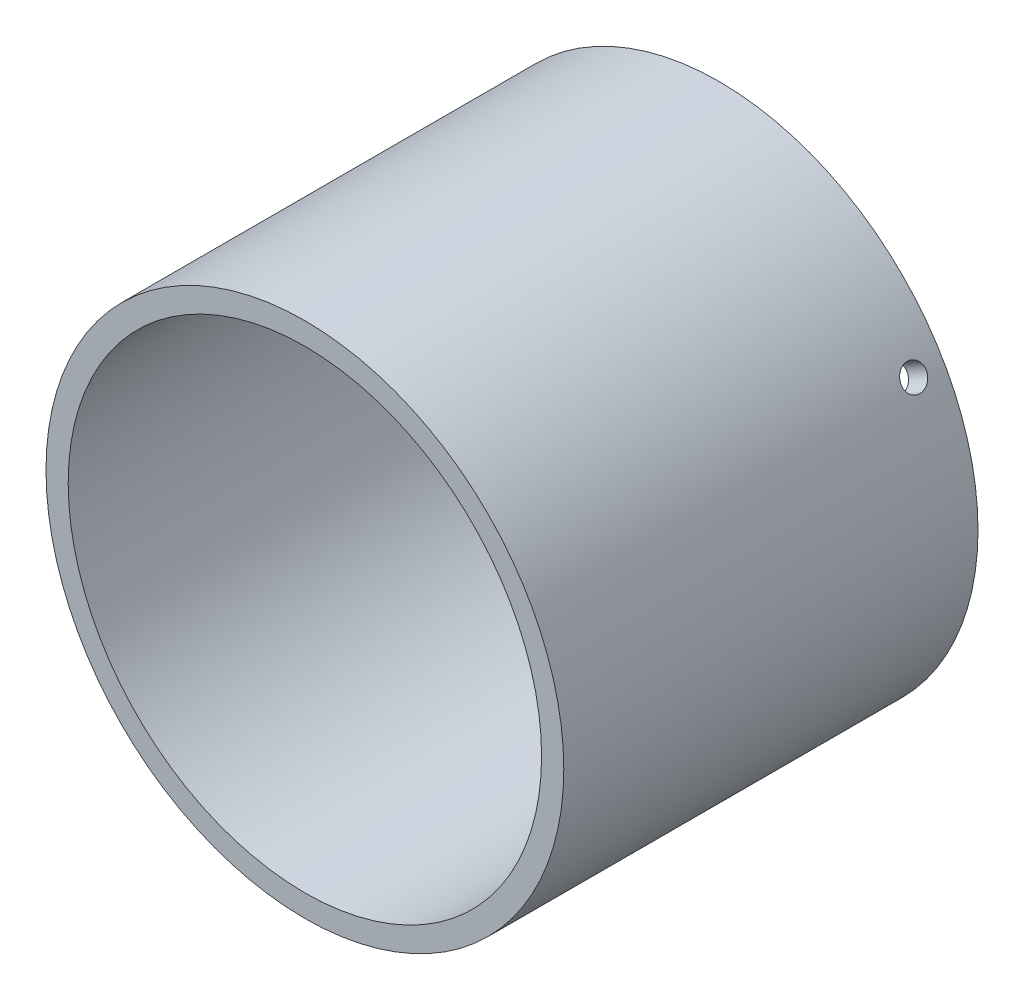
ISO-10303-21;
HEADER;
FILE_DESCRIPTION(('STEP AP214'),'2;1');
FILE_NAME('part.step','',(''),(''),'','','');
FILE_SCHEMA(('AUTOMOTIVE_DESIGN { 1 0 10303 214 1 1 1 1 }'));
ENDSEC;
DATA;
#1=APPLICATION_CONTEXT('core data for automotive mechanical design processes');
#2=APPLICATION_PROTOCOL_DEFINITION('international standard','automotive_design',2000,#1);
#3=PRODUCT_CONTEXT('',#1,'mechanical');
#4=PRODUCT('Part','Part','',(#3));
#5=PRODUCT_RELATED_PRODUCT_CATEGORY('part','',(#4));
#6=PRODUCT_DEFINITION_FORMATION('','',#4);
#7=PRODUCT_DEFINITION_CONTEXT('part definition',#1,'design');
#8=PRODUCT_DEFINITION('design','',#6,#7);
#9=PRODUCT_DEFINITION_SHAPE('','',#8);
#10=(LENGTH_UNIT() NAMED_UNIT(*) SI_UNIT(.MILLI.,.METRE.));
#11=(NAMED_UNIT(*) PLANE_ANGLE_UNIT() SI_UNIT($,.RADIAN.));
#12=(NAMED_UNIT(*) SI_UNIT($,.STERADIAN.) SOLID_ANGLE_UNIT());
#13=UNCERTAINTY_MEASURE_WITH_UNIT(LENGTH_MEASURE(1.E-05),#10,'distance_accuracy_value','');
#14=(GEOMETRIC_REPRESENTATION_CONTEXT(3) GLOBAL_UNCERTAINTY_ASSIGNED_CONTEXT((#13)) GLOBAL_UNIT_ASSIGNED_CONTEXT((#10,
#11,#12)) REPRESENTATION_CONTEXT('',''));
#15=CARTESIAN_POINT('',(0.,0.,0.));
#16=DIRECTION('',(0.,0.,1.));
#17=DIRECTION('',(1.,0.,0.));
#18=AXIS2_PLACEMENT_3D('',#15,#16,#17);
#19=CARTESIAN_POINT('',(0.,0.,56.));
#20=DIRECTION('',(0.,0.,1.));
#21=DIRECTION('',(1.,0.,0.));
#22=AXIS2_PLACEMENT_3D('',#19,#20,#21);
#23=PLANE('',#22);
#24=CARTESIAN_POINT('',(0.,0.,56.));
#25=DIRECTION('',(0.,0.,1.));
#26=DIRECTION('',(1.,0.,0.));
#27=AXIS2_PLACEMENT_3D('',#24,#25,#26);
#28=CIRCLE('',#27,35.);
#29=CARTESIAN_POINT('',(35.,0.,56.));
#30=VERTEX_POINT('',#29);
#31=EDGE_CURVE('E10',#30,#30,#28,.T.);
#32=ORIENTED_EDGE('',*,*,#31,.T.);
#33=EDGE_LOOP('',(#32));
#34=FACE_BOUND('',#33,.T.);
#35=CARTESIAN_POINT('',(0.,0.,56.));
#36=DIRECTION('',(0.,0.,1.));
#37=DIRECTION('',(1.,0.,0.));
#38=AXIS2_PLACEMENT_3D('',#35,#36,#37);
#39=CIRCLE('',#38,32.);
#40=CARTESIAN_POINT('',(32.,0.,56.));
#41=VERTEX_POINT('',#40);
#42=EDGE_CURVE('E49',#41,#41,#39,.T.);
#43=ORIENTED_EDGE('',*,*,#42,.F.);
#44=EDGE_LOOP('',(#43));
#45=FACE_BOUND('',#44,.T.);
#46=ADVANCED_FACE('F30',(#34,#45),#23,.T.);
#47=CARTESIAN_POINT('',(0.,0.,0.));
#48=DIRECTION('',(0.,0.,1.));
#49=DIRECTION('',(1.,0.,0.));
#50=AXIS2_PLACEMENT_3D('',#47,#48,#49);
#51=PLANE('',#50);
#52=CARTESIAN_POINT('',(0.,0.,0.));
#53=DIRECTION('',(0.,0.,1.));
#54=DIRECTION('',(1.,0.,0.));
#55=AXIS2_PLACEMENT_3D('',#52,#53,#54);
#56=CIRCLE('',#55,35.);
#57=CARTESIAN_POINT('',(35.,0.,0.));
#58=VERTEX_POINT('',#57);
#59=EDGE_CURVE('E44',#58,#58,#56,.T.);
#60=ORIENTED_EDGE('',*,*,#59,.F.);
#61=EDGE_LOOP('',(#60));
#62=FACE_BOUND('',#61,.T.);
#63=CARTESIAN_POINT('',(0.,0.,0.));
#64=DIRECTION('',(0.,0.,1.));
#65=DIRECTION('',(1.,0.,0.));
#66=AXIS2_PLACEMENT_3D('',#63,#64,#65);
#67=CIRCLE('',#66,32.);
#68=CARTESIAN_POINT('',(32.,0.,0.));
#69=VERTEX_POINT('',#68);
#70=EDGE_CURVE('E84',#69,#69,#67,.T.);
#71=ORIENTED_EDGE('',*,*,#70,.T.);
#72=EDGE_LOOP('',(#71));
#73=FACE_BOUND('',#72,.T.);
#74=ADVANCED_FACE('F96',(#62,#73),#51,.F.);
#75=CARTESIAN_POINT('',(0.,0.,56.));
#76=DIRECTION('',(0.,0.,-1.));
#77=DIRECTION('',(-1.,0.,0.));
#78=AXIS2_PLACEMENT_3D('',#75,#76,#77);
#79=CYLINDRICAL_SURFACE('',#78,35.);
#80=CARTESIAN_POINT('',(-29.4251135423138,18.9515881398351,3.99999999999999));
#81=CARTESIAN_POINT('',(-29.4251161295193,18.9515847689602,4.09542929950424));
#82=CARTESIAN_POINT('',(-29.4294867569684,18.9448034103171,4.19092636053496));
#83=CARTESIAN_POINT('',(-29.4468320161516,18.9178310435816,4.37928629635832));
#84=CARTESIAN_POINT('',(-29.4598167978485,18.8976242163654,4.47214592873519));
#85=CARTESIAN_POINT('',(-29.4939339353847,18.8443322046977,4.65247515129346));
#86=CARTESIAN_POINT('',(-29.5150621525123,18.8112535619652,4.73994745331193));
#87=CARTESIAN_POINT('',(-29.5647318090662,18.7330928228573,4.90704471580572));
#88=CARTESIAN_POINT('',(-29.5932714933423,18.6880135683491,4.98667152806437));
#89=CARTESIAN_POINT('',(-29.6568258035567,18.5869910633424,5.13591798592019));
#90=CARTESIAN_POINT('',(-29.6918458601599,18.5310386990014,5.20552915061215));
#91=CARTESIAN_POINT('',(-29.7671833827968,18.4097766884952,5.332696048194));
#92=CARTESIAN_POINT('',(-29.8075010644864,18.3444666613886,5.39025129006376));
#93=CARTESIAN_POINT('',(-29.8921470983969,18.2062106130465,5.49169537923105));
#94=CARTESIAN_POINT('',(-29.9364773523257,18.133260968513,5.53557770219226));
#95=CARTESIAN_POINT('',(-30.0277345790903,17.9817398960327,5.60838839802427));
#96=CARTESIAN_POINT('',(-30.0746615330862,17.9031685088725,5.6373168793747));
#97=CARTESIAN_POINT('',(-30.1696417211439,17.7426436634622,5.67937653954472));
#98=CARTESIAN_POINT('',(-30.2176940279789,17.6606929499696,5.6925202874632));
#99=CARTESIAN_POINT('',(-30.3135481406104,17.4956538671794,5.70267616375891));
#100=CARTESIAN_POINT('',(-30.3613499482898,17.4125655064511,5.69968841357984));
#101=CARTESIAN_POINT('',(-30.4553147096301,17.2476898285562,5.67767654500143));
#102=CARTESIAN_POINT('',(-30.5014790118324,17.1659014729429,5.65866595724484));
#103=CARTESIAN_POINT('',(-30.590968822413,17.0059117306484,5.60516902599532));
#104=CARTESIAN_POINT('',(-30.6342943193822,16.9277103583835,5.57068262031015));
#105=CARTESIAN_POINT('',(-30.717012763478,16.7771426932665,5.48719755887756));
#106=CARTESIAN_POINT('',(-30.7564040296294,16.7047788971478,5.43819273502778));
#107=CARTESIAN_POINT('',(-30.8302702925151,16.5680560578535,5.32706641326686));
#108=CARTESIAN_POINT('',(-30.8647452565939,16.5036970678484,5.26494482823714));
#109=CARTESIAN_POINT('',(-30.9280067846617,16.3848388557135,5.12927188813681));
#110=CARTESIAN_POINT('',(-30.9567874366723,16.3303498857932,5.05570879422109));
#111=CARTESIAN_POINT('',(-31.0079693262491,16.2329564469657,4.89928227457948));
#112=CARTESIAN_POINT('',(-31.0303705621904,16.1900519810094,4.81641884648467));
#113=CARTESIAN_POINT('',(-31.0683073306772,16.1171330396388,4.64373674526934));
#114=CARTESIAN_POINT('',(-31.0838426564224,16.0871189524819,4.55391786274715));
#115=CARTESIAN_POINT('',(-31.1077166696193,16.0409053971221,4.36987768756699));
#116=CARTESIAN_POINT('',(-31.1160554081505,16.0247058308677,4.27565642616089));
#117=CARTESIAN_POINT('',(-31.1253571715627,16.0066313263189,4.0855891701998));
#118=CARTESIAN_POINT('',(-31.1263277234367,16.0047417695967,3.98974493397244));
#119=CARTESIAN_POINT('',(-31.1208928212163,16.0153071760234,3.79906179049974));
#120=CARTESIAN_POINT('',(-31.1144873901166,16.0277620944534,3.7042228801212));
#121=CARTESIAN_POINT('',(-31.0944388606566,16.0666220674342,3.51828862223934));
#122=CARTESIAN_POINT('',(-31.0807992255448,16.0930204467723,3.42719150588277));
#123=CARTESIAN_POINT('',(-31.0465717370904,16.1589527840671,3.25127227349901));
#124=CARTESIAN_POINT('',(-31.0259838458351,16.1984868136974,3.16645019171414));
#125=CARTESIAN_POINT('',(-30.9782833616516,16.2895240218102,3.00541324891204));
#126=CARTESIAN_POINT('',(-30.9511654851112,16.3410368915773,2.92920543171134));
#127=CARTESIAN_POINT('',(-30.8910161531796,16.4544592965251,2.78763112351795));
#128=CARTESIAN_POINT('',(-30.8579846619868,16.5163688946484,2.72226469816452));
#129=CARTESIAN_POINT('',(-30.7867409634377,16.6487905735653,2.60417352871423));
#130=CARTESIAN_POINT('',(-30.7485244510564,16.7193097978444,2.55145939136334));
#131=CARTESIAN_POINT('',(-30.6678567351576,16.8668201071156,2.46024166638736));
#132=CARTESIAN_POINT('',(-30.6254055492954,16.943811165125,2.42173801951878));
#133=CARTESIAN_POINT('',(-30.5373661734603,17.1019720568498,2.36005280717796));
#134=CARTESIAN_POINT('',(-30.4917793841679,17.183140020704,2.33686444878646));
#135=CARTESIAN_POINT('',(-30.3986668854763,17.3473327980105,2.30644579812189));
#136=CARTESIAN_POINT('',(-30.3511411862041,17.4303576017635,2.29921542251108));
#137=CARTESIAN_POINT('',(-30.2555267779054,17.5958011698898,2.30091878498576));
#138=CARTESIAN_POINT('',(-30.2074386992385,17.6782204704287,2.30983588073879));
#139=CARTESIAN_POINT('',(-30.1120484792161,17.8402179317401,2.34354667170809));
#140=CARTESIAN_POINT('',(-30.0647463393494,17.919796087131,2.36834039699602));
#141=CARTESIAN_POINT('',(-29.9723545899891,18.0739049173578,2.43309728838201));
#142=CARTESIAN_POINT('',(-29.9272649992459,18.1484355494202,2.47306058301057));
#143=CARTESIAN_POINT('',(-29.8407057196631,18.2904128976407,2.56701921318819));
#144=CARTESIAN_POINT('',(-29.7992359180229,18.3578598345558,2.62101411127281));
#145=CARTESIAN_POINT('',(-29.7212094039953,18.4839179278283,2.74156244739717));
#146=CARTESIAN_POINT('',(-29.6846572532244,18.5425208865542,2.80812740975942));
#147=CARTESIAN_POINT('',(-29.6177089324535,18.64927074529,2.95192021670351));
#148=CARTESIAN_POINT('',(-29.5873142801093,18.6974150677415,3.02915068217299));
#149=CARTESIAN_POINT('',(-29.5336943897646,18.7819970657833,3.19214025408662));
#150=CARTESIAN_POINT('',(-29.5104758603398,18.8184237885021,3.27790724246493));
#151=CARTESIAN_POINT('',(-29.4720683285117,18.8785188071045,3.45541433761338));
#152=CARTESIAN_POINT('',(-29.4568698340926,18.9022021858758,3.54714723834309));
#153=CARTESIAN_POINT('',(-29.4390233600274,18.9299776881376,3.69954244611427));
#154=CARTESIAN_POINT('',(-29.433815090691,18.9380720025275,3.75921746596675));
#155=CARTESIAN_POINT('',(-29.4268593646416,18.9488782927464,3.87925261298606));
#156=CARTESIAN_POINT('',(-29.4251119051411,18.9515902729106,3.93961273960102));
#157=CARTESIAN_POINT('',(-29.4251135423138,18.9515881398351,3.99999999999999));
#158=B_SPLINE_CURVE_WITH_KNOTS('',3,(#80,#81,#82,#83,#84,#85,#86,#87,#88,#89,#90,#91,#92,#93,
#94,#95,#96,#97,#98,#99,#100,#101,#102,#103,#104,#105,#106,#107,#108,#109,#110,#111,#112,#113,
#114,#115,#116,#117,#118,#119,#120,#121,#122,#123,#124,#125,#126,#127,#128,#129,#130,#131,#132,
#133,#134,#135,#136,#137,#138,#139,#140,#141,#142,#143,#144,#145,#146,#147,#148,#149,#150,#151,
#152,#153,#154,#155,#156,#157),.UNSPECIFIED.,.T.,.F.,(4,2,2,2,2,2,2,2,2,2,2,2,2,2,2,2,2,2,2,2,2,
2,2,2,2,2,2,2,2,2,2,2,2,2,2,2,2,2,4),(0.,0.286067463119097,0.572472596475747,0.858732362610931,
1.14492439972246,1.43135736589339,1.71780199579334,2.00438310051121,2.29096212625491,
2.5773128026533,2.86366132330408,3.14976827612554,3.43587637872739,3.72210620815243,
4.00833793871138,4.29486530060146,4.58139273547376,4.86792879992848,5.15446283061314,
5.44070411216966,5.72694450136693,6.01304798151191,6.29915302278352,6.58549034294998,
6.87182939668354,7.15840766405092,7.44498473666101,7.73143461580975,8.01788299902108,
8.30403632326206,8.59019018950274,8.87634648035557,9.16249385076078,9.44890484805352,
9.73538635221262,10.0221348682386,10.3085432409842,10.4895656773952,10.6705879679997),.UNSPECIFIED.);
#159=CARTESIAN_POINT('',(-29.4251135423138,18.9515881398351,3.99999999999999));
#160=VERTEX_POINT('',#159);
#161=EDGE_CURVE('E60',#160,#160,#158,.T.);
#162=ORIENTED_EDGE('',*,*,#161,.T.);
#163=EDGE_LOOP('',(#162));
#164=FACE_BOUND('',#163,.T.);
#165=CARTESIAN_POINT('',(31.1251135423141,16.0071017669676,4.));
#166=CARTESIAN_POINT('',(31.1251119166535,16.0071056929908,4.09542929950425));
#167=CARTESIAN_POINT('',(31.121424401521,16.0142814467137,4.19092636053496));
#168=CARTESIAN_POINT('',(31.1067382763194,16.0427890651693,4.37928629635832));
#169=CARTESIAN_POINT('',(31.0957310414687,16.0641376295895,4.4721459287352));
#170=CARTESIAN_POINT('',(31.0666373743138,16.1203299432341,4.65247515129347));
#171=CARTESIAN_POINT('',(31.0485545379486,16.1551668373695,4.73994745331194));
#172=CARTESIAN_POINT('',(31.0057001805795,16.2372623912965,4.90704471580572));
#173=CARTESIAN_POINT('',(30.9809302431299,16.2845181101497,4.98667152806437));
#174=CARTESIAN_POINT('',(30.9252193425473,16.3900690098187,5.13591798592019));
#175=CARTESIAN_POINT('',(30.8942732019277,16.4483734506495,5.20552915061217));
#176=CARTESIAN_POINT('',(30.8269259816339,16.5742486643643,5.33269604819403));
#177=CARTESIAN_POINT('',(30.7905246798825,16.6418198144825,5.39025129006378));
#178=CARTESIAN_POINT('',(30.7131144467467,16.7842534543497,5.49169537923105));
#179=CARTESIAN_POINT('',(30.672103328348,16.8591194026749,5.53557770219227));
#180=CARTESIAN_POINT('',(30.5865108437537,17.0139110155721,5.60838839802427));
#181=CARTESIAN_POINT('',(30.5419295034603,17.0938366434349,5.6373168793747));
#182=CARTESIAN_POINT('',(30.4504010034253,17.2563543218542,5.67937653954473));
#183=CARTESIAN_POINT('',(30.4034557571,17.3389441970302,5.69252028746321));
#184=CARTESIAN_POINT('',(30.308454775102,17.5044758350213,5.70267616375892));
#185=CARTESIAN_POINT('',(30.2603990477923,17.5874175951827,5.69968841357984));
#186=CARTESIAN_POINT('',(30.1645949029393,17.7512313045114,5.67767654500143));
#187=CARTESIAN_POINT('',(30.1168462603456,17.8321049407732,5.65866595724485));
#188=CARTESIAN_POINT('',(30.0230359844639,17.989600261263,5.60516902599532));
#189=CARTESIAN_POINT('',(29.9769743579563,18.0662219284024,5.57068262031015));
#190=CARTESIAN_POINT('',(29.8879381570243,18.2131420349094,5.48719755887756));
#191=CARTESIAN_POINT('',(29.844964904347,18.2834377701431,5.4381927350278));
#192=CARTESIAN_POINT('',(29.7634925836834,18.4157692499319,5.32706641326689));
#193=CARTESIAN_POINT('',(29.7249935454165,18.4778049396212,5.26494482823715));
#194=CARTESIAN_POINT('',(29.6536900782933,18.5920201360776,5.12927188813682));
#195=CARTESIAN_POINT('',(29.6208915721214,18.6441893968164,5.0557087942211));
#196=CARTESIAN_POINT('',(29.5621373247233,18.7372109328174,4.89928227457949));
#197=CARTESIAN_POINT('',(29.53618158524,18.778063205197,4.81641884648469));
#198=CARTESIAN_POINT('',(29.4920003138394,18.8473768811293,4.64373674526936));
#199=CARTESIAN_POINT('',(29.4737750147627,18.8758379114591,4.55391786274716));
#200=CARTESIAN_POINT('',(29.4456899084204,18.9196201910578,4.369877687567));
#201=CARTESIAN_POINT('',(29.4358300417794,18.9349415335886,4.2756564261609));
#202=CARTESIAN_POINT('',(29.4248279433855,18.9520343492779,4.08558917019982));
#203=CARTESIAN_POINT('',(29.423676815199,18.9538196502176,3.98974493397245));
#204=CARTESIAN_POINT('',(29.4301092744557,18.9438301836142,3.79906179049975));
#205=CARTESIAN_POINT('',(29.4376928346683,18.9320554583448,3.70422288012122));
#206=CARTESIAN_POINT('',(29.4613222937301,18.8952629360335,3.51828862223935));
#207=CARTESIAN_POINT('',(29.4773641432997,18.8702514758592,3.42719150588278));
#208=CARTESIAN_POINT('',(29.5173494781006,18.8076434327026,3.25127227349902));
#209=CARTESIAN_POINT('',(29.5412930064468,18.7700467810501,3.16645019171414));
#210=CARTESIAN_POINT('',(29.5962832992704,18.6832183459179,3.00541324891204));
#211=CARTESIAN_POINT('',(29.6273358148403,18.6339771410537,2.92920543171135));
#212=CARTESIAN_POINT('',(29.6954878329177,18.5251750891063,2.78763112351797));
#213=CARTESIAN_POINT('',(29.7325873720341,18.4656141795468,2.72226469816454));
#214=CARTESIAN_POINT('',(29.8116460607134,18.3377044872853,2.60417352871425));
#215=CARTESIAN_POINT('',(29.8536092442036,18.2693484045795,2.55145939136335));
#216=CARTESIAN_POINT('',(29.9410230614032,18.1257329587103,2.46024166638736));
#217=CARTESIAN_POINT('',(29.9864736805725,18.0504736243282,2.42173801951879));
#218=CARTESIAN_POINT('',(30.0794253427738,17.8951488424592,2.36005280717798));
#219=CARTESIAN_POINT('',(30.1269254667988,17.8150855429279,2.33686444878647));
#220=CARTESIAN_POINT('',(30.2225643337183,17.6523513649979,2.30644579812189));
#221=CARTESIAN_POINT('',(30.2707030732765,17.569680500219,2.29921542251108));
#222=CARTESIAN_POINT('',(30.3661742020172,17.4041542096014,2.30091878498576));
#223=CARTESIAN_POINT('',(30.4135073707126,17.3212990615872,2.3098358807388));
#224=CARTESIAN_POINT('',(30.5061061775457,17.1576899771196,2.34354667170811));
#225=CARTESIAN_POINT('',(30.5513718117672,17.0769360446462,2.36834039699604));
#226=CARTESIAN_POINT('',(30.638638099011,16.9198680274867,2.43309728838202));
#227=CARTESIAN_POINT('',(30.6806387243655,16.8435539804257,2.47306058301058));
#228=CARTESIAN_POINT('',(30.760315074895,16.6976027712634,2.56701921318819));
#229=CARTESIAN_POINT('',(30.7979909348508,16.6279654010955,2.62101411127281));
#230=CARTESIAN_POINT('',(30.8681471889637,16.4973634111426,2.74156244739717));
#231=CARTESIAN_POINT('',(30.9006227645717,16.4364068406492,2.80812740975942));
#232=CARTESIAN_POINT('',(30.9595966937019,16.3250529647529,2.95192021670351));
#233=CARTESIAN_POINT('',(30.9860935738208,16.2746582624579,3.029150682173));
#234=CARTESIAN_POINT('',(31.0325337876555,16.1859310762504,3.19214025408663));
#235=CARTESIAN_POINT('',(31.0524709901942,16.1476098785706,3.27790724246494));
#236=CARTESIAN_POINT('',(31.0853110370307,16.0843004710096,3.45541433761339));
#237=CARTESIAN_POINT('',(31.0982221974846,16.0592964993576,3.5471472383431));
#238=CARTESIAN_POINT('',(31.1133532510136,16.0299532483183,3.69954244611429));
#239=CARTESIAN_POINT('',(31.1177589982332,16.0213955975683,3.75921746596677));
#240=CARTESIAN_POINT('',(31.1236396570587,16.0099686169983,3.87925261298608));
#241=CARTESIAN_POINT('',(31.1251145710253,16.0070992825966,3.93961273960103));
#242=CARTESIAN_POINT('',(31.1251135423141,16.0071017669676,4.));
#243=B_SPLINE_CURVE_WITH_KNOTS('',3,(#165,#166,#167,#168,#169,#170,#171,#172,#173,#174,#175,
#176,#177,#178,#179,#180,#181,#182,#183,#184,#185,#186,#187,#188,#189,#190,#191,#192,#193,#194,
#195,#196,#197,#198,#199,#200,#201,#202,#203,#204,#205,#206,#207,#208,#209,#210,#211,#212,#213,
#214,#215,#216,#217,#218,#219,#220,#221,#222,#223,#224,#225,#226,#227,#228,#229,#230,#231,#232,
#233,#234,#235,#236,#237,#238,#239,#240,#241,#242),.UNSPECIFIED.,.T.,.F.,(4,2,2,2,2,2,2,2,2,2,2,
2,2,2,2,2,2,2,2,2,2,2,2,2,2,2,2,2,2,2,2,2,2,2,2,2,2,2,4),(0.,0.286067463119089,
0.572472596475728,0.858732362610923,1.14492439972247,1.43135736589341,1.71780199579335,
2.00438310051119,2.29096212625486,2.57731280265329,2.86366132330411,3.14976827612556,
3.4358763787274,3.72210620815241,4.00833793871134,4.29486530060145,4.58139273547377,
4.86792879992848,5.15446283061314,5.44070411216965,5.72694450136692,6.01304798151191,
6.29915302278351,6.58549034294998,6.87182939668357,7.15840766405094,7.44498473666103,
7.73143461580977,8.01788299902111,8.30403632326205,8.59019018950271,8.87634648035556,
9.16249385076078,9.4489048480535,9.7353863522126,10.0221348682386,10.3085432409842,
10.4895656773952,10.6705879679997),.UNSPECIFIED.);
#244=CARTESIAN_POINT('',(31.1251135423141,16.0071017669676,4.));
#245=VERTEX_POINT('',#244);
#246=EDGE_CURVE('E125',#245,#245,#243,.T.);
#247=ORIENTED_EDGE('',*,*,#246,.T.);
#248=EDGE_LOOP('',(#247));
#249=FACE_BOUND('',#248,.T.);
#250=CARTESIAN_POINT('',(0.,-35.,5.7));
#251=CARTESIAN_POINT('',(0.0954293743822743,-34.9999994472995,5.69999578720194));
#252=CARTESIAN_POINT('',(0.190926510035618,-34.9996055294314,5.69193763240269));
#253=CARTESIAN_POINT('',(0.379286600913754,-34.9980719825392,5.65990619507327));
#254=CARTESIAN_POINT('',(0.472146313781193,-34.9969314738498,5.63591413805218));
#255=CARTESIAN_POINT('',(0.652475706480711,-34.9940338381992,5.5727032149443));
#256=CARTESIAN_POINT('',(0.739948097468028,-34.9922770244224,5.53349208157708));
#257=CARTESIAN_POINT('',(0.907045508807625,-34.9883446651304,5.44096787960112));
#258=CARTESIAN_POINT('',(0.986672381056032,-34.9861692187912,5.38765814989504));
#259=CARTESIAN_POINT('',(1.13591877025078,-34.9816420005491,5.26839283040727));
#260=CARTESIAN_POINT('',(1.20552982551339,-34.9792900820793,5.20242665655972));
#261=CARTESIAN_POINT('',(1.33269651215855,-34.9746762605858,5.05974200620119));
#262=CARTESIAN_POINT('',(1.39025165218579,-34.972414361234,4.98302309166019));
#263=CARTESIAN_POINT('',(1.49169563557403,-34.9682346194601,4.82096688406568));
#264=CARTESIAN_POINT('',(1.53557793569386,-34.9663169419534,4.73562549045032));
#265=CARTESIAN_POINT('',(1.60838858341058,-34.9630436624259,4.55877573279998));
#266=CARTESIAN_POINT('',(1.6373170397641,-34.9616880563173,4.46726741362141));
#267=CARTESIAN_POINT('',(1.67937664663565,-34.9596931012606,4.28075865304517));
#268=CARTESIAN_POINT('',(1.69252036443051,-34.9590531825345,4.18576105188712));
#269=CARTESIAN_POINT('',(1.70267616385266,-34.9585600529689,3.99490586355473));
#270=CARTESIAN_POINT('',(1.69968836724156,-34.9587068361914,3.89904828287701));
#271=CARTESIAN_POINT('',(1.67767642592836,-34.9597700283578,3.70927958354419));
#272=CARTESIAN_POINT('',(1.65866585858751,-34.9606857856866,3.61536688584667));
#273=CARTESIAN_POINT('',(1.60516905412589,-34.9631826833522,3.43206728306681));
#274=CARTESIAN_POINT('',(1.57068275435799,-34.9647638263826,3.34268039630698));
#275=CARTESIAN_POINT('',(1.48719791062039,-34.9684140352849,3.17092603520013));
#276=CARTESIAN_POINT('',(1.43819317356951,-34.9704833093003,3.08856157573386));
#277=CARTESIAN_POINT('',(1.32706703620335,-34.9748763365045,2.93322307394442));
#278=CARTESIAN_POINT('',(1.26494554882378,-34.9772000913824,2.86024909395706));
#279=CARTESIAN_POINT('',(1.12927267703632,-34.9818430629447,2.72568398556418));
#280=CARTESIAN_POINT('',(1.05570953409285,-34.9841622724468,2.66410471161981));
#281=CARTESIAN_POINT('',(0.899282875460667,-34.9885324354395,2.55416836458124));
#282=CARTESIAN_POINT('',(0.816419357566344,-34.9905833888663,2.50581129462273));
#283=CARTESIAN_POINT('',(0.64373723406546,-34.9941859736703,2.42369318707466));
#284=CARTESIAN_POINT('',(0.553918433129656,-34.9957375910179,2.38993255958086));
#285=CARTESIAN_POINT('',(0.369878434979043,-34.9981664246005,2.3379734096073));
#286=CARTESIAN_POINT('',(0.275657268879444,-34.9990436456013,2.31977477715539));
#287=CARTESIAN_POINT('',(0.08559005399087,-35.0000242080894,2.29947081278432));
#288=CARTESIAN_POINT('',(-0.0102542392489384,-35.0001283380813,2.29734908338549));
#289=CARTESIAN_POINT('',(-0.200937508670877,-34.9995530758056,2.30921636654421));
#290=CARTESIAN_POINT('',(-0.295776487986462,-34.9988736859809,2.32320532887155));
#291=CARTESIAN_POINT('',(-0.48171107228816,-34.9968084172084,2.3668833285713));
#292=CARTESIAN_POINT('',(-0.572808439263788,-34.9954228750191,2.3965648825203));
#293=CARTESIAN_POINT('',(-0.74872814215051,-34.992101306553,2.47077792844908));
#294=CARTESIAN_POINT('',(-0.833550443990365,-34.9901652772875,2.51530950105164));
#295=CARTESIAN_POINT('',(-0.994587531685297,-34.9859585905163,2.61800050038545));
#296=CARTESIAN_POINT('',(-1.07079529855487,-34.9836876635639,2.67617092289086));
#297=CARTESIAN_POINT('',(-1.21236949099692,-34.9790678464208,2.80447230528179));
#298=CARTESIAN_POINT('',(-1.27773585071559,-34.9767189557566,2.8746033378142));
#299=CARTESIAN_POINT('',(-1.39582688550679,-34.9722057130034,3.02490569536923));
#300=CARTESIAN_POINT('',(-1.4485409540428,-34.9700415167179,3.10508535915059));
#301=CARTESIAN_POINT('',(-1.53975855812572,-34.9661441530493,3.27316681039784));
#302=CARTESIAN_POINT('',(-1.57826215291306,-34.9644109838693,3.36106856567009));
#303=CARTESIAN_POINT('',(-1.63994732919217,-34.961572224974,3.5420596409462));
#304=CARTESIAN_POINT('',(-1.66313568108114,-34.9604663579783,3.63514664894854));
#305=CARTESIAN_POINT('',(-1.69355428663164,-34.9590061262685,3.82389821367127));
#306=CARTESIAN_POINT('',(-1.70078462413204,-34.9586517576062,3.91956275684736));
#307=CARTESIAN_POINT('',(-1.69908115355434,-34.9587345829485,4.11064822269173));
#308=CARTESIAN_POINT('',(-1.69016403316241,-34.9591709597527,4.20606929493125));
#309=CARTESIAN_POINT('',(-1.65645325466718,-34.9607843658987,4.39405796557313));
#310=CARTESIAN_POINT('',(-1.63165956617799,-34.9619613966581,4.48662555851391));
#311=CARTESIAN_POINT('',(-1.56690281332374,-34.9649232665694,4.66628324292673));
#312=CARTESIAN_POINT('',(-1.52693962049794,-34.9667081108686,4.75337328800569));
#313=CARTESIAN_POINT('',(-1.43298124661545,-34.9706843803893,4.91960861878185));
#314=CARTESIAN_POINT('',(-1.37898650283839,-34.9728757929399,4.99875415195551));
#315=CARTESIAN_POINT('',(-1.25843833301718,-34.9774207769775,5.14693693574019));
#316=CARTESIAN_POINT('',(-1.19187334760789,-34.9797744964441,5.21596477770322));
#317=CARTESIAN_POINT('',(-1.04808044749529,-34.9843778030766,5.34188725000349));
#318=CARTESIAN_POINT('',(-0.970849912154561,-34.9866273644679,5.39877888957914));
#319=CARTESIAN_POINT('',(-0.807860286807723,-34.990770343833,5.49883910515793));
#320=CARTESIAN_POINT('',(-0.722093327302723,-34.9926634284442,5.54199486168923));
#321=CARTESIAN_POINT('',(-0.544586294063647,-34.9958750819141,5.61324249435999));
#322=CARTESIAN_POINT('',(-0.452853426208433,-34.9971943295896,5.64135217828619));
#323=CARTESIAN_POINT('',(-0.300458140317944,-34.9987603966133,5.67432979024126));
#324=CARTESIAN_POINT('',(-0.240783003512232,-34.9992232072612,5.68394384469237));
#325=CARTESIAN_POINT('',(-0.12074762201948,-34.9998431837055,5.69678027992986));
#326=CARTESIAN_POINT('',(-0.0603873778821156,-35.000000349747,5.70000266584403));
#327=CARTESIAN_POINT('',(0.,-35.,5.7));
#328=B_SPLINE_CURVE_WITH_KNOTS('',3,(#250,#251,#252,#253,#254,#255,#256,#257,#258,#259,#260,
#261,#262,#263,#264,#265,#266,#267,#268,#269,#270,#271,#272,#273,#274,#275,#276,#277,#278,#279,
#280,#281,#282,#283,#284,#285,#286,#287,#288,#289,#290,#291,#292,#293,#294,#295,#296,#297,#298,
#299,#300,#301,#302,#303,#304,#305,#306,#307,#308,#309,#310,#311,#312,#313,#314,#315,#316,#317,
#318,#319,#320,#321,#322,#323,#324,#325,#326,#327),.UNSPECIFIED.,.T.,.F.,(4,2,2,2,2,2,2,2,2,2,2,
2,2,2,2,2,2,2,2,2,2,2,2,2,2,2,2,2,2,2,2,2,2,2,2,2,2,2,4),(0.,0.286067687995398,0.57247304132645,
0.858733063947017,1.14492535359925,1.43135802560014,1.71780236928562,2.00438358328462,
2.29096271300034,2.57731352648676,2.86366217858344,3.14976842848364,3.43587583657765,
3.72210546470313,4.00833699277805,4.29486464734991,4.58139236987288,4.86792814204014,
5.15446188932472,5.44070334993387,5.72694391809647,6.01304810790402,6.29915385103555,
6.58549105340195,6.87182999499825,7.15840814536849,7.4449851010423,7.73143528492444,
8.01788396387534,8.30403677966834,8.59019014312579,8.87634592988523,9.16249279994735,
9.44890409824575,9.73538589643007,10.0221342846274,10.3085425369651,10.4895653252384,
10.6705879682836),.UNSPECIFIED.);
#329=CARTESIAN_POINT('',(0.,-35.,5.7));
#330=VERTEX_POINT('',#329);
#331=EDGE_CURVE('E59',#330,#330,#328,.T.);
#332=ORIENTED_EDGE('',*,*,#331,.T.);
#333=EDGE_LOOP('',(#332));
#334=FACE_BOUND('',#333,.T.);
#335=ORIENTED_EDGE('',*,*,#31,.F.);
#336=EDGE_LOOP('',(#335));
#337=FACE_BOUND('',#336,.T.);
#338=ORIENTED_EDGE('',*,*,#59,.T.);
#339=EDGE_LOOP('',(#338));
#340=FACE_BOUND('',#339,.T.);
#341=ADVANCED_FACE('F32',(#164,#249,#334,#337,#340),#79,.T.);
#342=CARTESIAN_POINT('',(0.,0.,56.));
#343=DIRECTION('',(0.,0.,-1.));
#344=DIRECTION('',(-1.,0.,0.));
#345=AXIS2_PLACEMENT_3D('',#342,#343,#344);
#346=CYLINDRICAL_SURFACE('',#345,32.);
#347=CARTESIAN_POINT('',(-26.823678830253,17.4496491085476,3.99999999999999));
#348=CARTESIAN_POINT('',(-26.8236814596271,17.4496457672528,4.09541742990473));
#349=CARTESIAN_POINT('',(-26.8280831049577,17.4428846218098,4.1909023311868));
#350=CARTESIAN_POINT('',(-26.8455487672461,17.415991460344,4.37923746764485));
#351=CARTESIAN_POINT('',(-26.8586229622547,17.3958437338664,4.47208447332905));
#352=CARTESIAN_POINT('',(-26.8929662888946,17.3427033425647,4.65238837721729));
#353=CARTESIAN_POINT('',(-26.9142312089681,17.3097172789454,4.73984801876618));
#354=CARTESIAN_POINT('',(-26.964205520174,17.2317658338262,4.90692246559804));
#355=CARTESIAN_POINT('',(-26.9929131660998,17.1868032605689,4.98653910391526));
#356=CARTESIAN_POINT('',(-27.0568201297115,17.0860187801411,5.13578058407221));
#357=CARTESIAN_POINT('',(-27.0920258242513,17.0301862027266,5.20539549032864));
#358=CARTESIAN_POINT('',(-27.1677276522331,16.9091589983663,5.33257259787607));
#359=CARTESIAN_POINT('',(-27.208224002587,16.8439639875589,5.39013430474554));
#360=CARTESIAN_POINT('',(-27.2932048392677,16.7059131237946,5.49159920418358));
#361=CARTESIAN_POINT('',(-27.3376916011012,16.6330528956507,5.53549453898681));
#362=CARTESIAN_POINT('',(-27.4292183995809,16.4816805168216,5.60833026774923));
#363=CARTESIAN_POINT('',(-27.4762584150675,16.4031684129737,5.63727078562292));
#364=CARTESIAN_POINT('',(-27.5714009136266,16.2427379528917,5.67934879368121));
#365=CARTESIAN_POINT('',(-27.6195023411365,16.1608229150745,5.69250132208711));
#366=CARTESIAN_POINT('',(-27.7153919561144,15.9958167276514,5.7026764162082));
#367=CARTESIAN_POINT('',(-27.7631801462884,15.912725588225,5.69969912144333));
#368=CARTESIAN_POINT('',(-27.8570480454092,15.7478210890998,5.67771154457849));
#369=CARTESIAN_POINT('',(-27.9031294299153,15.6660065244711,5.65871744631498));
#370=CARTESIAN_POINT('',(-27.9924009624333,15.505930889799,5.60526052891797));
#371=CARTESIAN_POINT('',(-28.035591097175,15.4276698360658,5.57079763879265));
#372=CARTESIAN_POINT('',(-28.118004876521,15.2769496736045,5.48736298888306));
#373=CARTESIAN_POINT('',(-28.1572264941523,15.2044935337077,5.43838386441814));
#374=CARTESIAN_POINT('',(-28.2307352021525,15.0675690940801,5.32731245661083));
#375=CARTESIAN_POINT('',(-28.2650222529282,15.0031008584421,5.26522006806201));
#376=CARTESIAN_POINT('',(-28.3279178264144,14.8840056125753,5.12959323623196));
#377=CARTESIAN_POINT('',(-28.3565192807617,14.8293908599429,5.05604475067401));
#378=CARTESIAN_POINT('',(-28.4073653746327,14.7317559181869,4.89964279618987));
#379=CARTESIAN_POINT('',(-28.4296100122976,14.6887357324538,4.81678932454281));
#380=CARTESIAN_POINT('',(-28.4672747592672,14.6156070053033,4.64412065913509));
#381=CARTESIAN_POINT('',(-28.4826946129178,14.5854989475712,4.55430520472899));
#382=CARTESIAN_POINT('',(-28.5063922207159,14.539129494384,4.37026602229717));
#383=CARTESIAN_POINT('',(-28.5146700355066,14.5228679813577,4.276042331709));
#384=CARTESIAN_POINT('',(-28.5239111300896,14.5047095718986,4.08598463760185));
#385=CARTESIAN_POINT('',(-28.524883336793,14.5027951443992,3.99015274281776));
#386=CARTESIAN_POINT('',(-28.5195173424136,14.5133443501104,3.79949057550066));
#387=CARTESIAN_POINT('',(-28.5131791686779,14.5258079295345,3.70466029922204));
#388=CARTESIAN_POINT('',(-28.4933254236848,14.5647134505803,3.5187485215956));
#389=CARTESIAN_POINT('',(-28.4798139705923,14.5911473718178,3.42766490159484));
#390=CARTESIAN_POINT('',(-28.4458907585525,14.6571712311696,3.25176667109492));
#391=CARTESIAN_POINT('',(-28.4254789544633,14.6967612553506,3.16695210161218));
#392=CARTESIAN_POINT('',(-28.3781567984071,14.7879290980901,3.0059091954272));
#393=CARTESIAN_POINT('',(-28.3512401578256,14.8395185153566,2.9296892729018));
#394=CARTESIAN_POINT('',(-28.2914995400519,14.9530986829627,2.78808393137655));
#395=CARTESIAN_POINT('',(-28.2586755205023,15.0150895078827,2.72269859006975));
#396=CARTESIAN_POINT('',(-28.1878247162205,15.1476791152014,2.60455236413275));
#397=CARTESIAN_POINT('',(-28.1497927593888,15.2182864471313,2.55180417470377));
#398=CARTESIAN_POINT('',(-28.0694555250927,15.3659598625462,2.46051638643227));
#399=CARTESIAN_POINT('',(-28.0271502680172,15.4430259152149,2.4219767198021));
#400=CARTESIAN_POINT('',(-27.939351623392,15.6013079647118,2.36022214932912));
#401=CARTESIAN_POINT('',(-27.8938599353833,15.6825217431071,2.33699914388728));
#402=CARTESIAN_POINT('',(-27.8008733127031,15.8467771457823,2.30651058457052));
#403=CARTESIAN_POINT('',(-27.7533783912615,15.9298187579888,2.299244925325));
#404=CARTESIAN_POINT('',(-27.6577680841107,16.0952471482297,2.30087830309385));
#405=CARTESIAN_POINT('',(-27.6096535348424,16.1776346069406,2.30975743754514));
#406=CARTESIAN_POINT('',(-27.5141472899659,16.3395390498715,2.34338718540624));
#407=CARTESIAN_POINT('',(-27.4667555957011,16.4190560287571,2.36813782830913));
#408=CARTESIAN_POINT('',(-27.374131915528,16.5730196407242,2.4328038276619));
#409=CARTESIAN_POINT('',(-27.3288999394416,16.6474662507472,2.47271925307134));
#410=CARTESIAN_POINT('',(-27.2420179584243,16.789263849378,2.56657852252247));
#411=CARTESIAN_POINT('',(-27.2003678475056,16.8566150479531,2.62052195128388));
#412=CARTESIAN_POINT('',(-27.1219534919422,16.9824955243487,2.74097794950051));
#413=CARTESIAN_POINT('',(-27.0851947808091,17.041014820742,2.80750455146546));
#414=CARTESIAN_POINT('',(-27.0178374206119,17.1476076525124,2.95122621860593));
#415=CARTESIAN_POINT('',(-26.9872402874994,17.1956786174856,3.02842390135992));
#416=CARTESIAN_POINT('',(-26.9332379293052,17.2801394132882,3.19136336277028));
#417=CARTESIAN_POINT('',(-26.9098400984092,17.316517236146,3.27711380684542));
#418=CARTESIAN_POINT('',(-26.87111942049,17.3765424915989,3.45459846264817));
#419=CARTESIAN_POINT('',(-26.8557870541623,17.4002049323004,3.54632547607825));
#420=CARTESIAN_POINT('',(-26.8377547545697,17.42799681517,3.69885035367918));
#421=CARTESIAN_POINT('',(-26.8324844341078,17.436106832158,3.75866072787417));
#422=CARTESIAN_POINT('',(-26.825445639691,17.4469340359848,3.87897168509684));
#423=CARTESIAN_POINT('',(-26.8236771623183,17.4496512280869,3.93947226745081));
#424=CARTESIAN_POINT('',(-26.823678830253,17.4496491085476,3.99999999999999));
#425=B_SPLINE_CURVE_WITH_KNOTS('',3,(#347,#348,#349,#350,#351,#352,#353,#354,#355,#356,#357,
#358,#359,#360,#361,#362,#363,#364,#365,#366,#367,#368,#369,#370,#371,#372,#373,#374,#375,#376,
#377,#378,#379,#380,#381,#382,#383,#384,#385,#386,#387,#388,#389,#390,#391,#392,#393,#394,#395,
#396,#397,#398,#399,#400,#401,#402,#403,#404,#405,#406,#407,#408,#409,#410,#411,#412,#413,#414,
#415,#416,#417,#418,#419,#420,#421,#422,#423,#424),.UNSPECIFIED.,.T.,.F.,(4,2,2,2,2,2,2,2,2,2,2,
2,2,2,2,2,2,2,2,2,2,2,2,2,2,2,2,2,2,2,2,2,2,2,2,2,2,2,4),(0.,0.286031336912108,
0.572398953754047,0.858619520459205,1.14477303337536,1.4312088704143,1.71765645473413,
2.00426843519173,2.29087804076548,2.57721443058232,2.8635483436472,3.14959328293356,
3.43563953499582,3.7218311591968,4.00802507957253,4.29457260266899,4.58112020955478,
4.86767854950892,5.15423445626886,5.4404401559396,5.72664478495237,6.01268528186855,
6.29872765009119,6.58504766667804,6.87136973633152,7.15797824835486,7.44458539297541,
7.73104081769514,8.01749435086772,8.30359499661129,8.58969617400007,8.87579865240626,
9.16189266209525,9.44830761967478,9.73479295892002,10.0215715639149,10.3080109332934,
10.4894541473465,10.6708971843114),.UNSPECIFIED.);
#426=CARTESIAN_POINT('',(-26.823678830253,17.4496491085476,3.99999999999999));
#427=VERTEX_POINT('',#426);
#428=EDGE_CURVE('E35',#427,#427,#425,.T.);
#429=ORIENTED_EDGE('',*,*,#428,.F.);
#430=EDGE_LOOP('',(#429));
#431=FACE_BOUND('',#430,.T.);
#432=CARTESIAN_POINT('',(28.5236788302533,14.5051627356801,4.));
#433=CARTESIAN_POINT('',(28.5236772512941,14.5051666834322,4.09541742990475));
#434=CARTESIAN_POINT('',(28.5200227502471,14.5123591928285,4.19090233118681));
#435=CARTESIAN_POINT('',(28.5054654203738,14.540931480797,4.37923746764486));
#436=CARTESIAN_POINT('',(28.4945540749201,14.5623279290473,4.47208447332905));
#437=CARTESIAN_POINT('',(28.4657048094057,14.6186403180188,4.65238837721729));
#438=CARTESIAN_POINT('',(28.4477705003773,14.6535493108215,4.73984801876619));
#439=CARTESIAN_POINT('',(28.4052497242453,14.7358040564221,4.90692246559806));
#440=CARTESIAN_POINT('',(28.3806648165479,14.7831468937053,4.98653910391527));
#441=CARTESIAN_POINT('',(28.325336377996,14.8888841878857,5.13578058407223));
#442=CARTESIAN_POINT('',(28.2945867948662,14.9472895024223,5.20539549032866));
#443=CARTESIAN_POINT('',(28.2276250753321,15.0733628107476,5.33257259787609));
#444=CARTESIAN_POINT('',(28.1914127149498,15.1410311843183,5.39013430474554));
#445=CARTESIAN_POINT('',(28.1143475782559,15.2836521796008,5.49159920418357));
#446=CARTESIAN_POINT('',(28.0734921506744,15.3586089595527,5.53549453898682));
#447=CARTESIAN_POINT('',(27.9881632244171,15.5135596815777,5.60833026774924));
#448=CARTESIAN_POINT('',(27.9436897557236,15.5935535819075,5.63727078562294));
#449=CARTESIAN_POINT('',(27.8523241510313,15.7561646326801,5.67934879368123));
#450=CARTESIAN_POINT('',(27.8054343610845,15.8387792097706,5.69250132208713));
#451=CARTESIAN_POINT('',(27.7104796184835,16.0043251460122,5.70267641620821));
#452=CARTESIAN_POINT('',(27.6624146759978,16.0872565024169,5.69969912144333));
#453=CARTESIAN_POINT('',(27.5665371401174,16.251000737218,5.67771154457849));
#454=CARTESIAN_POINT('',(27.5187243410025,16.3318156691562,5.658717446315));
#455=CARTESIAN_POINT('',(27.4247305411085,16.4891649014875,5.60526052891798));
#456=CARTESIAN_POINT('',(27.3785495478194,16.5656991822334,5.57079763879265));
#457=CARTESIAN_POINT('',(27.2892289479384,16.7124316899996,5.48736298888306));
#458=CARTESIAN_POINT('',(27.2460908989433,16.7826266771942,5.43838386441815));
#459=CARTESIAN_POINT('',(27.164265209827,16.9147493055355,5.32731245661084));
#460=CARTESIAN_POINT('',(27.1255776054151,16.9766768803471,5.26522006806201));
#461=CARTESIAN_POINT('',(27.0538858837677,17.0906936677052,5.12959323623196));
#462=CARTESIAN_POINT('',(27.0208888477403,17.1427706300714,5.05604475067403));
#463=CARTESIAN_POINT('',(26.961757554818,17.2356221099248,4.89964279618989));
#464=CARTESIAN_POINT('',(26.9356232999301,17.2763966241071,4.81678932454282));
#465=CARTESIAN_POINT('',(26.8911243379561,17.3455796153852,4.64412065913511));
#466=CARTESIAN_POINT('',(26.8727599219268,17.3739876292353,4.55430520472901));
#467=CARTESIAN_POINT('',(26.8444516014062,17.417695086191,4.3702660222972));
#468=CARTESIAN_POINT('',(26.8345076254167,17.4329946406007,4.27604233170902));
#469=CARTESIAN_POINT('',(26.8234025288243,17.4500768679979,4.08598463760185));
#470=CARTESIAN_POINT('',(26.8222306893279,17.4518760374505,3.99015274281777));
#471=CARTESIAN_POINT('',(26.8286835722738,17.4419543471458,3.79949057550066));
#472=CARTESIAN_POINT('',(26.8363082618094,17.430233537965,3.70466029922205));
#473=CARTESIAN_POINT('',(26.8600745588859,17.3935869299178,3.5187485215956));
#474=CARTESIAN_POINT('',(26.876211279653,17.3686687076789,3.42766490159482));
#475=CARTESIAN_POINT('',(26.9164280130876,17.3062784145986,3.25176667109491));
#476=CARTESIAN_POINT('',(26.9405080777203,17.2688062616297,3.16695210161218));
#477=CARTESIAN_POINT('',(26.9958006675128,17.1822401509535,3.0059091954272));
#478=CARTESIAN_POINT('',(27.0270200931413,17.1331349477921,2.9296892729018));
#479=CARTESIAN_POINT('',(27.0955130947674,17.0246079713592,2.78808393137654));
#480=CARTESIAN_POINT('',(27.1327867141749,16.965186124115,2.72269859006975));
#481=CARTESIAN_POINT('',(27.2121872802497,16.8375327240691,2.60455236413275));
#482=CARTESIAN_POINT('',(27.2543190449786,16.7692924173322,2.55180417470378));
#483=CARTESIAN_POINT('',(27.3420393570434,16.6258816238546,2.46051638643229));
#484=CARTESIAN_POINT('',(27.3876278878863,16.5507111701792,2.42197671980211));
#485=CARTESIAN_POINT('',(27.480804841401,16.3955342887675,2.36022214932913));
#486=CARTESIAN_POINT('',(27.5283921926243,16.3155304420933,2.33699914388729));
#487=CARTESIAN_POINT('',(27.6241482327097,16.1528739633025,2.30651058457053));
#488=CARTESIAN_POINT('',(27.672316917731,16.0702213486801,2.29924492532501));
#489=CARTESIAN_POINT('',(27.7677769526114,15.9047061987034,2.30087830309386));
#490=CARTESIAN_POINT('',(27.8150693101741,15.8218440473899,2.30975743754516));
#491=CARTESIAN_POINT('',(27.9075295482995,15.6581809916414,2.34338718540625));
#492=CARTESIAN_POINT('',(27.9526974249143,15.5773800910369,2.36813782830912));
#493=CARTESIAN_POINT('',(28.0397219840497,15.4201838250314,2.4328038276619));
#494=CARTESIAN_POINT('',(28.081578651512,15.3437884796657,2.47271925307137));
#495=CARTESIAN_POINT('',(28.1609379836133,15.1976476776582,2.56657852252249));
#496=CARTESIAN_POINT('',(28.1984407770954,15.1279020242446,2.62052195128388));
#497=CARTESIAN_POINT('',(28.2682492897127,14.9970529621075,2.7409779495005));
#498=CARTESIAN_POINT('',(28.3005491314343,14.9359593362593,2.80750455146547));
#499=CARTESIAN_POINT('',(28.3591825515102,14.8243297353115,2.95122621860595));
#500=CARTESIAN_POINT('',(28.3855146618052,14.7737963582664,3.02842390135993));
#501=CARTESIAN_POINT('',(28.4316586774969,14.6847985463047,3.19136336277029));
#502=CARTESIAN_POINT('',(28.4514638807781,14.6463465189264,3.27711380684542));
#503=CARTESIAN_POINT('',(28.4840869379094,14.5828008004702,3.45459846264818));
#504=CARTESIAN_POINT('',(28.4969130295086,14.5576913613796,3.54632547607826));
#505=CARTESIAN_POINT('',(28.5119653562964,14.5281789904089,3.6988503536792));
#506=CARTESIAN_POINT('',(28.5163536768022,14.5195597505088,3.75866072787419));
#507=CARTESIAN_POINT('',(28.5222109131597,14.5080503738184,3.87897168509685));
#508=CARTESIAN_POINT('',(28.5236798318608,14.5051602314366,3.93947226745082));
#509=CARTESIAN_POINT('',(28.5236788302533,14.5051627356801,4.));
#510=B_SPLINE_CURVE_WITH_KNOTS('',3,(#432,#433,#434,#435,#436,#437,#438,#439,#440,#441,#442,
#443,#444,#445,#446,#447,#448,#449,#450,#451,#452,#453,#454,#455,#456,#457,#458,#459,#460,#461,
#462,#463,#464,#465,#466,#467,#468,#469,#470,#471,#472,#473,#474,#475,#476,#477,#478,#479,#480,
#481,#482,#483,#484,#485,#486,#487,#488,#489,#490,#491,#492,#493,#494,#495,#496,#497,#498,#499,
#500,#501,#502,#503,#504,#505,#506,#507,#508,#509),.UNSPECIFIED.,.T.,.F.,(4,2,2,2,2,2,2,2,2,2,2,
2,2,2,2,2,2,2,2,2,2,2,2,2,2,2,2,2,2,2,2,2,2,2,2,2,2,2,4),(0.,0.286031336912101,
0.572398953754034,0.858619520459201,1.14477303337537,1.4312088704143,1.71765645473413,
2.00426843519172,2.29087804076546,2.57721443058229,2.86354834364718,3.14959328293355,
3.43563953499583,3.72183115919679,4.00802507957252,4.29457260266897,4.58112020955475,
4.86767854950889,5.15423445626884,5.44044015593959,5.72664478495237,6.01268528186855,
6.29872765009121,6.58504766667804,6.8713697363315,7.15797824835484,7.44458539297537,
7.7310408176951,8.01749435086768,8.30359499661125,8.58969617400004,8.87579865240625,
9.16189266209525,9.44830761967475,9.73479295891997,10.0215715639149,10.3080109332934,
10.4894541473465,10.6708971843114),.UNSPECIFIED.);
#511=CARTESIAN_POINT('',(28.5236788302533,14.5051627356801,4.));
#512=VERTEX_POINT('',#511);
#513=EDGE_CURVE('E61',#512,#512,#510,.T.);
#514=ORIENTED_EDGE('',*,*,#513,.F.);
#515=EDGE_LOOP('',(#514));
#516=FACE_BOUND('',#515,.T.);
#517=CARTESIAN_POINT('',(0.,-32.,5.7));
#518=CARTESIAN_POINT('',(0.0954175370485076,-31.9999993967333,5.69999579176408));
#519=CARTESIAN_POINT('',(0.190902545110489,-31.9995686570321,5.69193962790624));
#520=CARTESIAN_POINT('',(0.379237903441386,-31.9978917607866,5.65991655999478));
#521=CARTESIAN_POINT('',(0.472085024302095,-31.9966446461934,5.63593096162602));
#522=CARTESIAN_POINT('',(0.652389171655528,-31.9934761364988,5.57273820005213));
#523=CARTESIAN_POINT('',(0.73984894051746,-31.9915550878466,5.53353885667471));
#524=CARTESIAN_POINT('',(0.906923600366172,-31.9872549995101,5.44104350028688));
#525=CARTESIAN_POINT('',(0.986540324548433,-31.9848760672352,5.38775079217285));
#526=CARTESIAN_POINT('',(1.13578170651259,-31.9799247940324,5.26851523446713));
#527=CARTESIAN_POINT('',(1.20539645620325,-31.9773522651161,5.20255999021003));
#528=CARTESIAN_POINT('',(1.33257326193003,-31.9723053549348,5.05989657508976));
#529=CARTESIAN_POINT('',(1.39013482306501,-31.9698309777033,4.98318796291158));
#530=CARTESIAN_POINT('',(1.4915995710709,-31.9652580336836,4.82114207466245));
#531=CARTESIAN_POINT('',(1.53549487314215,-31.9631596841411,4.73579985487793));
#532=CARTESIAN_POINT('',(1.60833053299377,-31.9595777558835,4.55894406410243));
#533=CARTESIAN_POINT('',(1.63727101508499,-31.9580941720582,4.46743054441708));
#534=CARTESIAN_POINT('',(1.67934894694422,-31.9559108035243,4.28092233744723));
#535=CARTESIAN_POINT('',(1.69250143229216,-31.9552102731244,4.18593105119427));
#536=CARTESIAN_POINT('',(1.70267641646615,-31.9546697720654,3.99508655928277));
#537=CARTESIAN_POINT('',(1.69969905526726,-31.9548297939383,3.89923336111113));
#538=CARTESIAN_POINT('',(1.67771137426562,-31.9559916590528,3.70948822189607));
#539=CARTESIAN_POINT('',(1.65871730514496,-31.9569926490375,3.61559439177334));
#540=CARTESIAN_POINT('',(1.60526056897541,-31.9597222888423,3.43232975134687));
#541=CARTESIAN_POINT('',(1.57079783028482,-31.9614509420324,3.34295896199331));
#542=CARTESIAN_POINT('',(1.48736349176675,-31.9654420633362,3.17122498924953));
#543=CARTESIAN_POINT('',(1.43838449156882,-31.9677048036067,3.08886540779763));
#544=CARTESIAN_POINT('',(1.32731334783092,-31.9725087983964,2.93353112812219));
#545=CARTESIAN_POINT('',(1.26522109916131,-31.9750500551483,2.86055650514594));
#546=CARTESIAN_POINT('',(1.12959436527058,-31.9801284597382,2.72596904811831));
#547=CARTESIAN_POINT('',(1.05604580954476,-31.9826655985944,2.66437039199097));
#548=CARTESIAN_POINT('',(0.899643656081539,-31.9874467877261,2.55439270439255));
#549=CARTESIAN_POINT('',(0.81679005585771,-31.9896908379233,2.50601367645393));
#550=CARTESIAN_POINT('',(0.644121358358616,-31.9936330663506,2.42384987058245));
#551=CARTESIAN_POINT('',(0.55430602059595,-31.9953312257128,2.39006559707841));
#552=CARTESIAN_POINT('',(0.370267091289369,-31.9979900239452,2.33805962524724));
#553=CARTESIAN_POINT('',(0.276043536987047,-31.9989506690448,2.31983779547016));
#554=CARTESIAN_POINT('',(0.0859859019003999,-32.0000253751397,2.29949145764314));
#555=CARTESIAN_POINT('',(-0.00984607412820241,-32.0001404673869,2.29734734085107));
#556=CARTESIAN_POINT('',(-0.200508420989313,-31.9995138362609,2.30916610600271));
#557=CARTESIAN_POINT('',(-0.295338795567751,-31.9987721160932,2.32312892768588));
#558=CARTESIAN_POINT('',(-0.481251040027967,-31.9965160559608,2.36674898543018));
#559=CARTESIAN_POINT('',(-0.572335018732972,-31.9950021572648,2.39639725825233));
#560=CARTESIAN_POINT('',(-0.748233922738471,-31.9913721553416,2.47053752205896));
#561=CARTESIAN_POINT('',(-0.83304880726701,-31.9892560481983,2.51502960957194));
#562=CARTESIAN_POINT('',(-0.99409192134382,-31.9846570475555,2.61764467360297));
#563=CARTESIAN_POINT('',(-1.07031177219472,-31.9821738015145,2.67578078353838));
#564=CARTESIAN_POINT('',(-1.2119169486811,-31.9771213171132,2.80401444985806));
#565=CARTESIAN_POINT('',(-1.27730219631748,-31.9745520781342,2.8741120923469));
#566=CARTESIAN_POINT('',(-1.39544822946555,-31.9696142326906,3.02436342043947));
#567=CARTESIAN_POINT('',(-1.44819632016578,-31.9672458295079,3.10452709584771));
#568=CARTESIAN_POINT('',(-1.53948393500815,-31.9629799381475,3.27258452448931));
#569=CARTESIAN_POINT('',(-1.57802352693195,-31.9610824477232,3.36047824084402));
#570=CARTESIAN_POINT('',(-1.63977804583169,-31.9579738111998,3.54145389197999));
#571=CARTESIAN_POINT('',(-1.6630010420941,-31.9567623037499,3.6345330668149));
#572=CARTESIAN_POINT('',(-1.69348953706935,-31.9551612395672,3.82327601479072));
#573=CARTESIAN_POINT('',(-1.70075514187086,-31.9547716773699,3.91893977074443));
#574=CARTESIAN_POINT('',(-1.69912160939603,-31.9548585678211,4.11001001157775));
#575=CARTESIAN_POINT('',(-1.69024243953124,-31.9553339507298,4.20541666829786));
#576=CARTESIAN_POINT('',(-1.656612709024,-31.9570948923909,4.39338264248137));
#577=CARTESIAN_POINT('',(-1.63186211844014,-31.9583804526717,4.48594195457293));
#578=CARTESIAN_POINT('',(-1.56719631679541,-31.9616166149744,4.6655896897816));
#579=CARTESIAN_POINT('',(-1.52728103701432,-31.96356722001,4.75267808810466));
#580=CARTESIAN_POINT('',(-1.43342213439731,-31.9679135758117,4.9189189718361));
#581=CARTESIAN_POINT('',(-1.37947892657619,-31.9703093134079,4.99807169192472));
#582=CARTESIAN_POINT('',(-1.25902316678393,-31.9752793279122,5.14629458179296));
#583=CARTESIAN_POINT('',(-1.1924965321046,-31.9778538027904,5.21535329989724));
#584=CARTESIAN_POINT('',(-1.04877473219,-31.9828896506326,5.34134439824621));
#585=CARTESIAN_POINT('',(-0.971576949734882,-31.9853509956522,5.39827379490588));
#586=CARTESIAN_POINT('',(-0.808637411772702,-31.9898851260302,5.49842032851789));
#587=CARTESIAN_POINT('',(-0.722887008604006,-31.9919575118808,5.54162339809271));
#588=CARTESIAN_POINT('',(-0.545402440465787,-31.9954743943321,5.61296721075447));
#589=CARTESIAN_POINT('',(-0.453675473562776,-31.9969196307519,5.64112571034511));
#590=CARTESIAN_POINT('',(-0.301150483961551,-31.9986379127017,5.67421045748714));
#591=CARTESIAN_POINT('',(-0.241339942706,-31.9991464448928,5.68386915271195));
#592=CARTESIAN_POINT('',(-0.121028650566097,-31.9998276797192,5.69676525559222));
#593=CARTESIAN_POINT('',(-0.060527900352237,-32.0000003826808,5.700002669485));
#594=CARTESIAN_POINT('',(0.,-32.,5.7));
#595=B_SPLINE_CURVE_WITH_KNOTS('',3,(#517,#518,#519,#520,#521,#522,#523,#524,#525,#526,#527,
#528,#529,#530,#531,#532,#533,#534,#535,#536,#537,#538,#539,#540,#541,#542,#543,#544,#545,#546,
#547,#548,#549,#550,#551,#552,#553,#554,#555,#556,#557,#558,#559,#560,#561,#562,#563,#564,#565,
#566,#567,#568,#569,#570,#571,#572,#573,#574,#575,#576,#577,#578,#579,#580,#581,#582,#583,#584,
#585,#586,#587,#588,#589,#590,#591,#592,#593,#594),.UNSPECIFIED.,.T.,.F.,(4,2,2,2,2,2,2,2,2,2,2,
2,2,2,2,2,2,2,2,2,2,2,2,2,2,2,2,2,2,2,2,2,2,2,2,2,2,2,4),(0.,0.28603165869372,0.572399590295864,
0.858620524001253,1.14477439827539,1.43120981436695,1.71765698912563,2.00426912570233,
2.29087887979788,2.57721546614834,2.86354956766943,3.14959350135175,3.4356387598339,
3.72183009537391,4.00802372541286,4.29457166775884,4.58111968667419,4.86767760856643,
5.15423310999059,5.44043906491677,5.72664394907041,6.01268546168328,6.29872883444466,
6.58504868341941,6.8713705935421,7.15797893700549,7.44458591318553,7.73104177451318,
8.01749573140565,8.30359565089984,8.58969611012245,8.87579786585183,9.16189115825348,
9.44830654619511,9.73479230580526,10.0215707292756,10.3080099277304,10.4894536443408,
10.6708971847058),.UNSPECIFIED.);
#596=CARTESIAN_POINT('',(0.,-32.,5.7));
#597=VERTEX_POINT('',#596);
#598=EDGE_CURVE('E53',#597,#597,#595,.T.);
#599=ORIENTED_EDGE('',*,*,#598,.F.);
#600=EDGE_LOOP('',(#599));
#601=FACE_BOUND('',#600,.T.);
#602=ORIENTED_EDGE('',*,*,#42,.T.);
#603=EDGE_LOOP('',(#602));
#604=FACE_BOUND('',#603,.T.);
#605=ORIENTED_EDGE('',*,*,#70,.F.);
#606=EDGE_LOOP('',(#605));
#607=FACE_BOUND('',#606,.T.);
#608=ADVANCED_FACE('F66',(#431,#516,#601,#604,#607),#346,.F.);
#609=CARTESIAN_POINT('',(0.,-35.,4.));
#610=DIRECTION('',(0.,1.,0.));
#611=DIRECTION('',(0.,0.,1.));
#612=AXIS2_PLACEMENT_3D('',#609,#610,#611);
#613=CYLINDRICAL_SURFACE('',#612,1.7);
#614=ORIENTED_EDGE('',*,*,#598,.T.);
#615=EDGE_LOOP('',(#614));
#616=FACE_BOUND('',#615,.T.);
#617=ORIENTED_EDGE('',*,*,#331,.F.);
#618=EDGE_LOOP('',(#617));
#619=FACE_BOUND('',#618,.T.);
#620=ADVANCED_FACE('F69',(#616,#619),#613,.F.);
#621=CARTESIAN_POINT('',(41.4054445662278,23.9054445662273,4.));
#622=DIRECTION('',(-0.866025403784443,-0.499999999999993,0.));
#623=DIRECTION('',(0.499999999999991,-0.866025403784443,0.));
#624=AXIS2_PLACEMENT_3D('',#621,#622,#623);
#625=CYLINDRICAL_SURFACE('',#624,1.7);
#626=ORIENTED_EDGE('',*,*,#513,.T.);
#627=EDGE_LOOP('',(#626));
#628=FACE_BOUND('',#627,.T.);
#629=ORIENTED_EDGE('',*,*,#246,.F.);
#630=EDGE_LOOP('',(#629));
#631=FACE_BOUND('',#630,.T.);
#632=ADVANCED_FACE('F72',(#628,#631),#625,.F.);
#633=CARTESIAN_POINT('',(-41.4054445662276,23.9054445662279,3.99999999999999));
#634=DIRECTION('',(0.866025403784436,-0.500000000000003,0.));
#635=DIRECTION('',(0.500000000000005,0.866025403784436,0.));
#636=AXIS2_PLACEMENT_3D('',#633,#634,#635);
#637=CYLINDRICAL_SURFACE('',#636,1.7);
#638=ORIENTED_EDGE('',*,*,#428,.T.);
#639=EDGE_LOOP('',(#638));
#640=FACE_BOUND('',#639,.T.);
#641=ORIENTED_EDGE('',*,*,#161,.F.);
#642=EDGE_LOOP('',(#641));
#643=FACE_BOUND('',#642,.T.);
#644=ADVANCED_FACE('F74',(#640,#643),#637,.F.);
#645=CLOSED_SHELL('',(#46,#74,#341,#608,#620,#632,#644));
#646=MANIFOLD_SOLID_BREP('B2',#645);
#647=ADVANCED_BREP_SHAPE_REPRESENTATION('',(#18,#646),#14);
#648=SHAPE_DEFINITION_REPRESENTATION(#9,#647);
ENDSEC;
END-ISO-10303-21;
